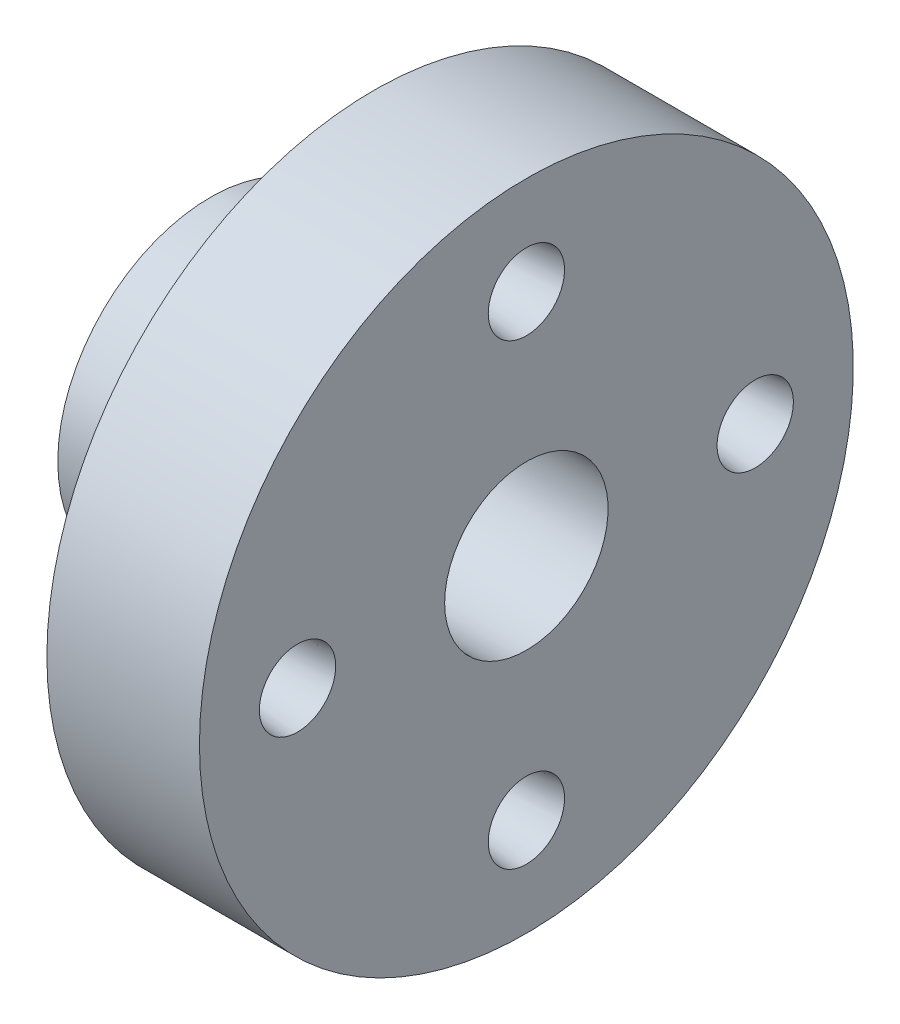
ISO-10303-21;
HEADER;
FILE_DESCRIPTION(('STEP AP214'),'2;1');
FILE_NAME('part.step','',(''),(''),'','','');
FILE_SCHEMA(('AUTOMOTIVE_DESIGN { 1 0 10303 214 1 1 1 1 }'));
ENDSEC;
DATA;
#1=APPLICATION_CONTEXT('core data for automotive mechanical design processes');
#2=APPLICATION_PROTOCOL_DEFINITION('international standard','automotive_design',2000,#1);
#3=PRODUCT_CONTEXT('',#1,'mechanical');
#4=PRODUCT('Part','Part','',(#3));
#5=PRODUCT_RELATED_PRODUCT_CATEGORY('part','',(#4));
#6=PRODUCT_DEFINITION_FORMATION('','',#4);
#7=PRODUCT_DEFINITION_CONTEXT('part definition',#1,'design');
#8=PRODUCT_DEFINITION('design','',#6,#7);
#9=PRODUCT_DEFINITION_SHAPE('','',#8);
#10=(LENGTH_UNIT() NAMED_UNIT(*) SI_UNIT(.MILLI.,.METRE.));
#11=(NAMED_UNIT(*) PLANE_ANGLE_UNIT() SI_UNIT($,.RADIAN.));
#12=(NAMED_UNIT(*) SI_UNIT($,.STERADIAN.) SOLID_ANGLE_UNIT());
#13=UNCERTAINTY_MEASURE_WITH_UNIT(LENGTH_MEASURE(1.E-05),#10,'distance_accuracy_value','');
#14=(GEOMETRIC_REPRESENTATION_CONTEXT(3) GLOBAL_UNCERTAINTY_ASSIGNED_CONTEXT((#13)) GLOBAL_UNIT_ASSIGNED_CONTEXT((#10,
#11,#12)) REPRESENTATION_CONTEXT('',''));
#15=CARTESIAN_POINT('',(0.,0.,0.));
#16=DIRECTION('',(0.,0.,1.));
#17=DIRECTION('',(1.,0.,0.));
#18=AXIS2_PLACEMENT_3D('',#15,#16,#17);
#19=CARTESIAN_POINT('',(29.,-15.,0.));
#20=DIRECTION('',(-1.,0.,0.));
#21=DIRECTION('',(0.,0.,1.));
#22=AXIS2_PLACEMENT_3D('',#19,#20,#21);
#23=PLANE('',#22);
#24=CARTESIAN_POINT('',(29.,-42.,0.));
#25=DIRECTION('',(-1.,0.,0.));
#26=DIRECTION('',(0.,0.,-1.));
#27=AXIS2_PLACEMENT_3D('',#24,#25,#26);
#28=CIRCLE('',#27,7.);
#29=CARTESIAN_POINT('',(29.,-42.,-7.));
#30=VERTEX_POINT('',#29);
#31=EDGE_CURVE('E83',#30,#30,#28,.T.);
#32=ORIENTED_EDGE('',*,*,#31,.T.);
#33=EDGE_LOOP('',(#32));
#34=FACE_BOUND('',#33,.T.);
#35=CARTESIAN_POINT('',(29.,42.,0.));
#36=DIRECTION('',(-1.,0.,0.));
#37=DIRECTION('',(0.,0.,1.));
#38=AXIS2_PLACEMENT_3D('',#35,#36,#37);
#39=CIRCLE('',#38,7.);
#40=CARTESIAN_POINT('',(29.,42.,7.));
#41=VERTEX_POINT('',#40);
#42=EDGE_CURVE('E65',#41,#41,#39,.T.);
#43=ORIENTED_EDGE('',*,*,#42,.T.);
#44=EDGE_LOOP('',(#43));
#45=FACE_BOUND('',#44,.T.);
#46=CARTESIAN_POINT('',(29.,0.,0.));
#47=DIRECTION('',(-1.,0.,0.));
#48=DIRECTION('',(0.,0.,1.));
#49=AXIS2_PLACEMENT_3D('',#46,#47,#48);
#50=CIRCLE('',#49,60.);
#51=CARTESIAN_POINT('',(29.,0.,60.));
#52=VERTEX_POINT('',#51);
#53=EDGE_CURVE('E44',#52,#52,#50,.T.);
#54=ORIENTED_EDGE('',*,*,#53,.F.);
#55=EDGE_LOOP('',(#54));
#56=FACE_BOUND('',#55,.T.);
#57=CARTESIAN_POINT('',(29.,0.,0.));
#58=DIRECTION('',(-1.,0.,0.));
#59=DIRECTION('',(0.,0.,1.));
#60=AXIS2_PLACEMENT_3D('',#57,#58,#59);
#61=CIRCLE('',#60,15.);
#62=CARTESIAN_POINT('',(29.,0.,15.));
#63=VERTEX_POINT('',#62);
#64=EDGE_CURVE('E40',#63,#63,#61,.T.);
#65=ORIENTED_EDGE('',*,*,#64,.T.);
#66=EDGE_LOOP('',(#65));
#67=FACE_BOUND('',#66,.T.);
#68=CARTESIAN_POINT('',(29.,-1.46642216231412E-13,-42.));
#69=DIRECTION('',(-1.,0.,0.));
#70=DIRECTION('',(0.,1.,0.));
#71=AXIS2_PLACEMENT_3D('',#68,#69,#70);
#72=CIRCLE('',#71,7.);
#73=CARTESIAN_POINT('',(29.,6.99999999999985,-42.));
#74=VERTEX_POINT('',#73);
#75=EDGE_CURVE('E74',#74,#74,#72,.T.);
#76=ORIENTED_EDGE('',*,*,#75,.T.);
#77=EDGE_LOOP('',(#76));
#78=FACE_BOUND('',#77,.T.);
#79=CARTESIAN_POINT('',(29.,4.39926648694235E-13,42.));
#80=DIRECTION('',(-1.,0.,0.));
#81=DIRECTION('',(0.,-1.,0.));
#82=AXIS2_PLACEMENT_3D('',#79,#80,#81);
#83=CIRCLE('',#82,7.);
#84=CARTESIAN_POINT('',(29.,-6.99999999999956,42.0000000000001));
#85=VERTEX_POINT('',#84);
#86=EDGE_CURVE('E92',#85,#85,#83,.T.);
#87=ORIENTED_EDGE('',*,*,#86,.T.);
#88=EDGE_LOOP('',(#87));
#89=FACE_BOUND('',#88,.T.);
#90=ADVANCED_FACE('F33',(#34,#45,#56,#67,#78,#89),#23,.F.);
#91=CARTESIAN_POINT('',(1.00000000000001,-60.,0.));
#92=DIRECTION('',(1.,0.,0.));
#93=DIRECTION('',(0.,0.,-1.));
#94=AXIS2_PLACEMENT_3D('',#91,#92,#93);
#95=PLANE('',#94);
#96=CARTESIAN_POINT('',(1.00000000000001,-42.,0.));
#97=DIRECTION('',(-1.,0.,0.));
#98=DIRECTION('',(0.,0.,-1.));
#99=AXIS2_PLACEMENT_3D('',#96,#97,#98);
#100=CIRCLE('',#99,5.69999999999999);
#101=CARTESIAN_POINT('',(1.00000000000001,-42.,-5.69999999999999));
#102=VERTEX_POINT('',#101);
#103=EDGE_CURVE('E77',#102,#102,#100,.T.);
#104=ORIENTED_EDGE('',*,*,#103,.F.);
#105=EDGE_LOOP('',(#104));
#106=FACE_BOUND('',#105,.T.);
#107=CARTESIAN_POINT('',(1.00000000000001,42.,0.));
#108=DIRECTION('',(-1.,0.,0.));
#109=DIRECTION('',(0.,0.,1.));
#110=AXIS2_PLACEMENT_3D('',#107,#108,#109);
#111=CIRCLE('',#110,5.69999999999999);
#112=CARTESIAN_POINT('',(1.00000000000001,42.,5.69999999999999));
#113=VERTEX_POINT('',#112);
#114=EDGE_CURVE('E59',#113,#113,#111,.T.);
#115=ORIENTED_EDGE('',*,*,#114,.F.);
#116=EDGE_LOOP('',(#115));
#117=FACE_BOUND('',#116,.T.);
#118=CARTESIAN_POINT('',(1.00000000000001,0.,0.));
#119=DIRECTION('',(-1.,0.,0.));
#120=DIRECTION('',(0.,0.,1.));
#121=AXIS2_PLACEMENT_3D('',#118,#119,#120);
#122=CIRCLE('',#121,28.);
#123=CARTESIAN_POINT('',(1.00000000000001,0.,28.));
#124=VERTEX_POINT('',#123);
#125=EDGE_CURVE('E53',#124,#124,#122,.T.);
#126=ORIENTED_EDGE('',*,*,#125,.F.);
#127=EDGE_LOOP('',(#126));
#128=FACE_BOUND('',#127,.T.);
#129=CARTESIAN_POINT('',(1.00000000000001,0.,0.));
#130=DIRECTION('',(-1.,0.,0.));
#131=DIRECTION('',(0.,0.,1.));
#132=AXIS2_PLACEMENT_3D('',#129,#130,#131);
#133=CIRCLE('',#132,60.);
#134=CARTESIAN_POINT('',(1.00000000000001,0.,60.));
#135=VERTEX_POINT('',#134);
#136=EDGE_CURVE('E48',#135,#135,#133,.T.);
#137=ORIENTED_EDGE('',*,*,#136,.T.);
#138=EDGE_LOOP('',(#137));
#139=FACE_BOUND('',#138,.T.);
#140=CARTESIAN_POINT('',(1.00000000000001,-1.46642216231412E-13,-42.));
#141=DIRECTION('',(-1.,0.,0.));
#142=DIRECTION('',(0.,1.,0.));
#143=AXIS2_PLACEMENT_3D('',#140,#141,#142);
#144=CIRCLE('',#143,5.69999999999999);
#145=CARTESIAN_POINT('',(1.00000000000001,5.69999999999984,-42.));
#146=VERTEX_POINT('',#145);
#147=EDGE_CURVE('E68',#146,#146,#144,.T.);
#148=ORIENTED_EDGE('',*,*,#147,.F.);
#149=EDGE_LOOP('',(#148));
#150=FACE_BOUND('',#149,.T.);
#151=CARTESIAN_POINT('',(1.00000000000001,4.39926648694235E-13,42.));
#152=DIRECTION('',(-1.,0.,0.));
#153=DIRECTION('',(0.,-1.,0.));
#154=AXIS2_PLACEMENT_3D('',#151,#152,#153);
#155=CIRCLE('',#154,5.69999999999999);
#156=CARTESIAN_POINT('',(1.00000000000001,-5.69999999999955,42.0000000000001));
#157=VERTEX_POINT('',#156);
#158=EDGE_CURVE('E86',#157,#157,#155,.T.);
#159=ORIENTED_EDGE('',*,*,#158,.F.);
#160=EDGE_LOOP('',(#159));
#161=FACE_BOUND('',#160,.T.);
#162=ADVANCED_FACE('F109',(#106,#117,#128,#139,#150,#161),#95,.F.);
#163=CARTESIAN_POINT('',(-29.,-28.,0.));
#164=DIRECTION('',(1.,0.,0.));
#165=DIRECTION('',(0.,0.,-1.));
#166=AXIS2_PLACEMENT_3D('',#163,#164,#165);
#167=PLANE('',#166);
#168=CARTESIAN_POINT('',(-29.,0.,0.));
#169=DIRECTION('',(-1.,0.,0.));
#170=DIRECTION('',(0.,0.,1.));
#171=AXIS2_PLACEMENT_3D('',#168,#169,#170);
#172=CIRCLE('',#171,15.);
#173=CARTESIAN_POINT('',(-29.,0.,15.));
#174=VERTEX_POINT('',#173);
#175=EDGE_CURVE('E10',#174,#174,#172,.T.);
#176=ORIENTED_EDGE('',*,*,#175,.F.);
#177=EDGE_LOOP('',(#176));
#178=FACE_BOUND('',#177,.T.);
#179=CARTESIAN_POINT('',(-29.,0.,0.));
#180=DIRECTION('',(-1.,0.,0.));
#181=DIRECTION('',(0.,0.,1.));
#182=AXIS2_PLACEMENT_3D('',#179,#180,#181);
#183=CIRCLE('',#182,28.);
#184=CARTESIAN_POINT('',(-29.,0.,28.));
#185=VERTEX_POINT('',#184);
#186=EDGE_CURVE('E56',#185,#185,#183,.T.);
#187=ORIENTED_EDGE('',*,*,#186,.T.);
#188=EDGE_LOOP('',(#187));
#189=FACE_BOUND('',#188,.T.);
#190=ADVANCED_FACE('F35',(#178,#189),#167,.F.);
#191=CARTESIAN_POINT('',(-59.7431531897602,0.,0.));
#192=DIRECTION('',(-1.,0.,0.));
#193=DIRECTION('',(0.,0.,1.));
#194=AXIS2_PLACEMENT_3D('',#191,#192,#193);
#195=CYLINDRICAL_SURFACE('',#194,15.);
#196=ORIENTED_EDGE('',*,*,#64,.F.);
#197=EDGE_LOOP('',(#196));
#198=FACE_BOUND('',#197,.T.);
#199=ORIENTED_EDGE('',*,*,#175,.T.);
#200=EDGE_LOOP('',(#199));
#201=FACE_BOUND('',#200,.T.);
#202=ADVANCED_FACE('F120',(#198,#201),#195,.F.);
#203=CARTESIAN_POINT('',(-59.7431531897602,0.,0.));
#204=DIRECTION('',(-1.,0.,0.));
#205=DIRECTION('',(0.,0.,1.));
#206=AXIS2_PLACEMENT_3D('',#203,#204,#205);
#207=CYLINDRICAL_SURFACE('',#206,60.);
#208=ORIENTED_EDGE('',*,*,#136,.F.);
#209=EDGE_LOOP('',(#208));
#210=FACE_BOUND('',#209,.T.);
#211=ORIENTED_EDGE('',*,*,#53,.T.);
#212=EDGE_LOOP('',(#211));
#213=FACE_BOUND('',#212,.T.);
#214=ADVANCED_FACE('F119',(#210,#213),#207,.T.);
#215=CARTESIAN_POINT('',(-59.7431531897602,0.,0.));
#216=DIRECTION('',(-1.,0.,0.));
#217=DIRECTION('',(0.,0.,1.));
#218=AXIS2_PLACEMENT_3D('',#215,#216,#217);
#219=CYLINDRICAL_SURFACE('',#218,28.);
#220=ORIENTED_EDGE('',*,*,#186,.F.);
#221=EDGE_LOOP('',(#220));
#222=FACE_BOUND('',#221,.T.);
#223=ORIENTED_EDGE('',*,*,#125,.T.);
#224=EDGE_LOOP('',(#223));
#225=FACE_BOUND('',#224,.T.);
#226=ADVANCED_FACE('F127',(#222,#225),#219,.T.);
#227=CARTESIAN_POINT('',(-8.79336252144099,42.,0.));
#228=DIRECTION('',(-1.,0.,0.));
#229=DIRECTION('',(0.,0.,1.));
#230=AXIS2_PLACEMENT_3D('',#227,#228,#229);
#231=CYLINDRICAL_SURFACE('',#230,5.69999999999999);
#232=ORIENTED_EDGE('',*,*,#114,.T.);
#233=EDGE_LOOP('',(#232));
#234=FACE_BOUND('',#233,.T.);
#235=CARTESIAN_POINT('',(16.,42.,0.));
#236=DIRECTION('',(-1.,0.,0.));
#237=DIRECTION('',(0.,0.,1.));
#238=AXIS2_PLACEMENT_3D('',#235,#236,#237);
#239=CIRCLE('',#238,5.69999999999999);
#240=CARTESIAN_POINT('',(16.,42.,5.69999999999999));
#241=VERTEX_POINT('',#240);
#242=EDGE_CURVE('E62',#241,#241,#239,.T.);
#243=ORIENTED_EDGE('',*,*,#242,.F.);
#244=EDGE_LOOP('',(#243));
#245=FACE_BOUND('',#244,.T.);
#246=ADVANCED_FACE('F137',(#234,#245),#231,.F.);
#247=CARTESIAN_POINT('',(29.,42.,0.));
#248=DIRECTION('',(1.,0.,0.));
#249=DIRECTION('',(0.,0.,-1.));
#250=AXIS2_PLACEMENT_3D('',#247,#248,#249);
#251=CONICAL_SURFACE('',#250,7.,0.0996686524911629);
#252=ORIENTED_EDGE('',*,*,#242,.T.);
#253=EDGE_LOOP('',(#252));
#254=FACE_BOUND('',#253,.T.);
#255=ORIENTED_EDGE('',*,*,#42,.F.);
#256=EDGE_LOOP('',(#255));
#257=FACE_BOUND('',#256,.T.);
#258=ADVANCED_FACE('F154',(#254,#257),#251,.F.);
#259=CARTESIAN_POINT('',(-8.79336252144099,-1.46642216231412E-13,-42.));
#260=DIRECTION('',(-1.,0.,0.));
#261=DIRECTION('',(0.,1.,0.));
#262=AXIS2_PLACEMENT_3D('',#259,#260,#261);
#263=CYLINDRICAL_SURFACE('',#262,5.69999999999999);
#264=ORIENTED_EDGE('',*,*,#147,.T.);
#265=EDGE_LOOP('',(#264));
#266=FACE_BOUND('',#265,.T.);
#267=CARTESIAN_POINT('',(16.,-1.46642216231412E-13,-42.));
#268=DIRECTION('',(-1.,0.,0.));
#269=DIRECTION('',(0.,1.,0.));
#270=AXIS2_PLACEMENT_3D('',#267,#268,#269);
#271=CIRCLE('',#270,5.69999999999999);
#272=CARTESIAN_POINT('',(16.,5.69999999999984,-42.));
#273=VERTEX_POINT('',#272);
#274=EDGE_CURVE('E71',#273,#273,#271,.T.);
#275=ORIENTED_EDGE('',*,*,#274,.F.);
#276=EDGE_LOOP('',(#275));
#277=FACE_BOUND('',#276,.T.);
#278=ADVANCED_FACE('F150',(#266,#277),#263,.F.);
#279=CARTESIAN_POINT('',(29.,-1.46642216231412E-13,-42.));
#280=DIRECTION('',(1.,0.,0.));
#281=DIRECTION('',(0.,-1.,0.));
#282=AXIS2_PLACEMENT_3D('',#279,#280,#281);
#283=CONICAL_SURFACE('',#282,7.,0.0996686524911629);
#284=ORIENTED_EDGE('',*,*,#274,.T.);
#285=EDGE_LOOP('',(#284));
#286=FACE_BOUND('',#285,.T.);
#287=ORIENTED_EDGE('',*,*,#75,.F.);
#288=EDGE_LOOP('',(#287));
#289=FACE_BOUND('',#288,.T.);
#290=ADVANCED_FACE('F153',(#286,#289),#283,.F.);
#291=CARTESIAN_POINT('',(-8.79336252144099,-42.,0.));
#292=DIRECTION('',(-1.,0.,0.));
#293=DIRECTION('',(0.,0.,-1.));
#294=AXIS2_PLACEMENT_3D('',#291,#292,#293);
#295=CYLINDRICAL_SURFACE('',#294,5.69999999999999);
#296=ORIENTED_EDGE('',*,*,#103,.T.);
#297=EDGE_LOOP('',(#296));
#298=FACE_BOUND('',#297,.T.);
#299=CARTESIAN_POINT('',(16.,-42.,0.));
#300=DIRECTION('',(-1.,0.,0.));
#301=DIRECTION('',(0.,0.,-1.));
#302=AXIS2_PLACEMENT_3D('',#299,#300,#301);
#303=CIRCLE('',#302,5.69999999999999);
#304=CARTESIAN_POINT('',(16.,-42.,-5.69999999999999));
#305=VERTEX_POINT('',#304);
#306=EDGE_CURVE('E80',#305,#305,#303,.T.);
#307=ORIENTED_EDGE('',*,*,#306,.F.);
#308=EDGE_LOOP('',(#307));
#309=FACE_BOUND('',#308,.T.);
#310=ADVANCED_FACE('F160',(#298,#309),#295,.F.);
#311=CARTESIAN_POINT('',(29.,-42.,0.));
#312=DIRECTION('',(1.,0.,0.));
#313=DIRECTION('',(0.,0.,1.));
#314=AXIS2_PLACEMENT_3D('',#311,#312,#313);
#315=CONICAL_SURFACE('',#314,7.,0.0996686524911629);
#316=ORIENTED_EDGE('',*,*,#306,.T.);
#317=EDGE_LOOP('',(#316));
#318=FACE_BOUND('',#317,.T.);
#319=ORIENTED_EDGE('',*,*,#31,.F.);
#320=EDGE_LOOP('',(#319));
#321=FACE_BOUND('',#320,.T.);
#322=ADVANCED_FACE('F105',(#318,#321),#315,.F.);
#323=CARTESIAN_POINT('',(-8.79336252144099,4.39926648694235E-13,42.));
#324=DIRECTION('',(-1.,0.,0.));
#325=DIRECTION('',(0.,-1.,0.));
#326=AXIS2_PLACEMENT_3D('',#323,#324,#325);
#327=CYLINDRICAL_SURFACE('',#326,5.69999999999999);
#328=ORIENTED_EDGE('',*,*,#158,.T.);
#329=EDGE_LOOP('',(#328));
#330=FACE_BOUND('',#329,.T.);
#331=CARTESIAN_POINT('',(16.,4.39926648694235E-13,42.));
#332=DIRECTION('',(-1.,0.,0.));
#333=DIRECTION('',(0.,-1.,0.));
#334=AXIS2_PLACEMENT_3D('',#331,#332,#333);
#335=CIRCLE('',#334,5.69999999999999);
#336=CARTESIAN_POINT('',(16.,-5.69999999999955,42.0000000000001));
#337=VERTEX_POINT('',#336);
#338=EDGE_CURVE('E89',#337,#337,#335,.T.);
#339=ORIENTED_EDGE('',*,*,#338,.F.);
#340=EDGE_LOOP('',(#339));
#341=FACE_BOUND('',#340,.T.);
#342=ADVANCED_FACE('F99',(#330,#341),#327,.F.);
#343=CARTESIAN_POINT('',(29.,4.39926648694235E-13,42.));
#344=DIRECTION('',(1.,0.,0.));
#345=DIRECTION('',(0.,1.,0.));
#346=AXIS2_PLACEMENT_3D('',#343,#344,#345);
#347=CONICAL_SURFACE('',#346,7.,0.0996686524911629);
#348=ORIENTED_EDGE('',*,*,#338,.T.);
#349=EDGE_LOOP('',(#348));
#350=FACE_BOUND('',#349,.T.);
#351=ORIENTED_EDGE('',*,*,#86,.F.);
#352=EDGE_LOOP('',(#351));
#353=FACE_BOUND('',#352,.T.);
#354=ADVANCED_FACE('F97',(#350,#353),#347,.F.);
#355=CLOSED_SHELL('',(#90,#162,#190,#202,#214,#226,#246,#258,#278,#290,#310,#322,#342,#354));
#356=MANIFOLD_SOLID_BREP('B2',#355);
#357=ADVANCED_BREP_SHAPE_REPRESENTATION('',(#18,#356),#14);
#358=SHAPE_DEFINITION_REPRESENTATION(#9,#357);
ENDSEC;
END-ISO-10303-21;
